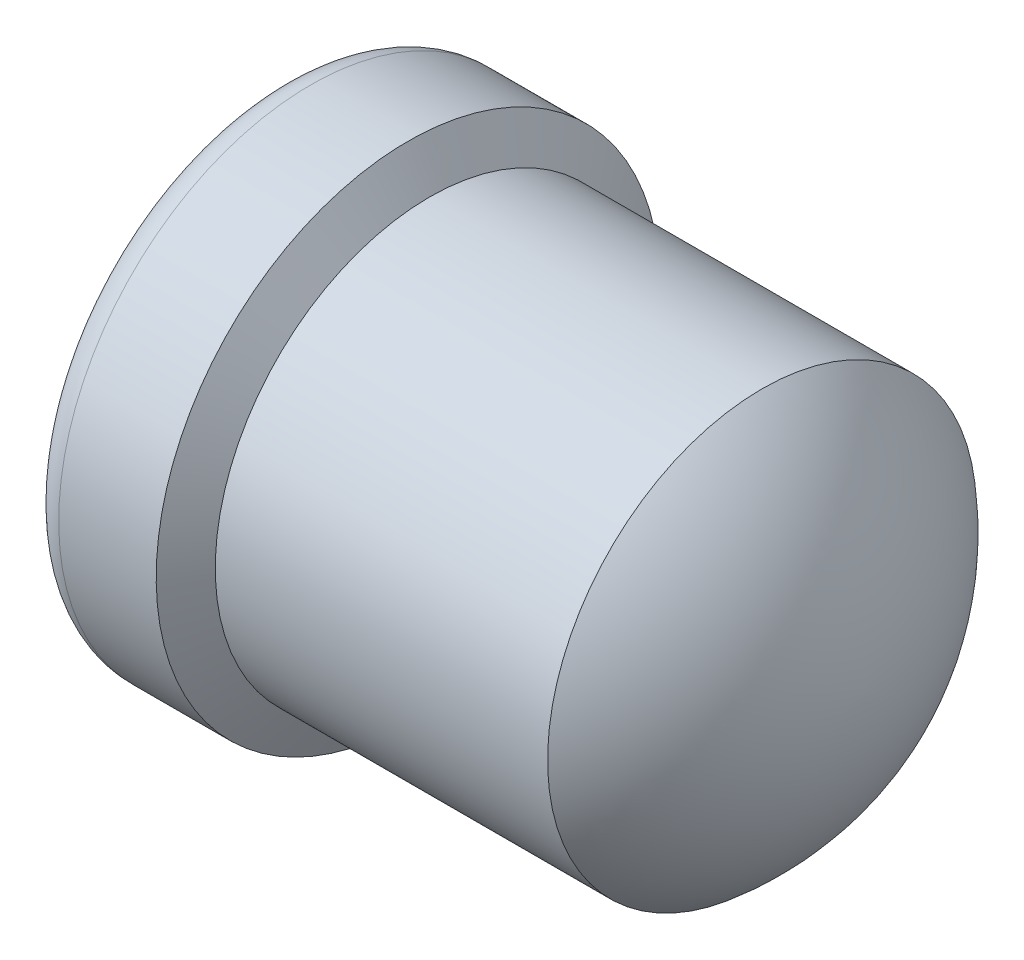
ISO-10303-21;
HEADER;
FILE_DESCRIPTION(('STEP AP214'),'2;1');
FILE_NAME('part.step','',(''),(''),'','','');
FILE_SCHEMA(('AUTOMOTIVE_DESIGN { 1 0 10303 214 1 1 1 1 }'));
ENDSEC;
DATA;
#1=APPLICATION_CONTEXT('core data for automotive mechanical design processes');
#2=APPLICATION_PROTOCOL_DEFINITION('international standard','automotive_design',2000,#1);
#3=PRODUCT_CONTEXT('',#1,'mechanical');
#4=PRODUCT('Part','Part','',(#3));
#5=PRODUCT_RELATED_PRODUCT_CATEGORY('part','',(#4));
#6=PRODUCT_DEFINITION_FORMATION('','',#4);
#7=PRODUCT_DEFINITION_CONTEXT('part definition',#1,'design');
#8=PRODUCT_DEFINITION('design','',#6,#7);
#9=PRODUCT_DEFINITION_SHAPE('','',#8);
#10=(LENGTH_UNIT() NAMED_UNIT(*) SI_UNIT(.MILLI.,.METRE.));
#11=(NAMED_UNIT(*) PLANE_ANGLE_UNIT() SI_UNIT($,.RADIAN.));
#12=(NAMED_UNIT(*) SI_UNIT($,.STERADIAN.) SOLID_ANGLE_UNIT());
#13=UNCERTAINTY_MEASURE_WITH_UNIT(LENGTH_MEASURE(1.E-05),#10,'distance_accuracy_value','');
#14=(GEOMETRIC_REPRESENTATION_CONTEXT(3) GLOBAL_UNCERTAINTY_ASSIGNED_CONTEXT((#13)) GLOBAL_UNIT_ASSIGNED_CONTEXT((#10,
#11,#12)) REPRESENTATION_CONTEXT('',''));
#15=CARTESIAN_POINT('',(0.,0.,0.));
#16=DIRECTION('',(0.,0.,1.));
#17=DIRECTION('',(1.,0.,0.));
#18=AXIS2_PLACEMENT_3D('',#15,#16,#17);
#19=CARTESIAN_POINT('',(0.736738308288009,0.014025354886126,0.));
#20=DIRECTION('',(0.,0.,-1.));
#21=DIRECTION('',(0.,-1.,0.));
#22=AXIS2_PLACEMENT_3D('',#19,#20,#21);
#23=CIRCLE('',#22,0.7112);
#24=TRIMMED_CURVE('',#23,(PARAMETER_VALUE(-1.55107435810092)),
(PARAMETER_VALUE(1.55107435810092)),.T.,.PARAMETER.);
#25=CARTESIAN_POINT('',(0.736738308288009,0.,0.));
#26=DIRECTION('',(-1.,0.,0.));
#27=AXIS1_PLACEMENT('',#25,#26);
#28=SURFACE_OF_REVOLUTION('',#24,#27);
#29=CARTESIAN_POINT('',(1.1938,0.,0.));
#30=DIRECTION('',(-1.,0.,0.));
#31=DIRECTION('',(0.,-1.,0.));
#32=AXIS2_PLACEMENT_3D('',#29,#30,#31);
#33=CIRCLE('',#32,0.530859999999994);
#34=CARTESIAN_POINT('',(1.1938,-0.530859999999994,0.));
#35=VERTEX_POINT('',#34);
#36=EDGE_CURVE('E11',#35,#35,#33,.T.);
#37=ORIENTED_EDGE('',*,*,#36,.F.);
#38=EDGE_LOOP('',(#37));
#39=FACE_BOUND('',#38,.T.);
#40=CARTESIAN_POINT('',(1.4478,0.,0.));
#41=VERTEX_POINT('',#40);
#42=VERTEX_LOOP('',#41);
#43=FACE_BOUND('',#42,.T.);
#44=ADVANCED_FACE('F32',(#39,#43),#28,.T.);
#45=CARTESIAN_POINT('',(0.,0.,0.));
#46=DIRECTION('',(-1.,0.,0.));
#47=DIRECTION('',(0.,-1.,0.));
#48=AXIS2_PLACEMENT_3D('',#45,#46,#47);
#49=CYLINDRICAL_SURFACE('',#48,0.530859999999994);
#50=CARTESIAN_POINT('',(0.371026143456576,0.,0.));
#51=DIRECTION('',(-1.,0.,0.));
#52=DIRECTION('',(0.,-1.,0.));
#53=AXIS2_PLACEMENT_3D('',#50,#51,#52);
#54=CIRCLE('',#53,0.530859999999994);
#55=CARTESIAN_POINT('',(0.371026143456576,-0.530859999999994,0.));
#56=VERTEX_POINT('',#55);
#57=EDGE_CURVE('E39',#56,#56,#54,.T.);
#58=ORIENTED_EDGE('',*,*,#57,.F.);
#59=EDGE_LOOP('',(#58));
#60=FACE_BOUND('',#59,.T.);
#61=ORIENTED_EDGE('',*,*,#36,.T.);
#62=EDGE_LOOP('',(#61));
#63=FACE_BOUND('',#62,.T.);
#64=ADVANCED_FACE('F75',(#60,#63),#49,.T.);
#65=CARTESIAN_POINT('',(0.371026143456576,0.,0.));
#66=DIRECTION('',(-1.,0.,0.));
#67=DIRECTION('',(0.,-1.,0.));
#68=AXIS2_PLACEMENT_3D('',#65,#66,#67);
#69=CONICAL_SURFACE('',#68,0.530859999999994,1.04719755119674);
#70=CARTESIAN_POINT('',(0.317500000000026,0.,0.));
#71=DIRECTION('',(-1.,0.,0.));
#72=DIRECTION('',(0.,-1.,0.));
#73=AXIS2_PLACEMENT_3D('',#70,#71,#72);
#74=CIRCLE('',#73,0.62356999999999);
#75=CARTESIAN_POINT('',(0.317500000000026,-0.62356999999999,0.));
#76=VERTEX_POINT('',#75);
#77=EDGE_CURVE('E68',#76,#76,#74,.T.);
#78=ORIENTED_EDGE('',*,*,#77,.F.);
#79=EDGE_LOOP('',(#78));
#80=FACE_BOUND('',#79,.T.);
#81=ORIENTED_EDGE('',*,*,#57,.T.);
#82=EDGE_LOOP('',(#81));
#83=FACE_BOUND('',#82,.T.);
#84=ADVANCED_FACE('F73',(#80,#83),#69,.T.);
#85=CARTESIAN_POINT('',(0.,0.,0.));
#86=DIRECTION('',(-1.,0.,0.));
#87=DIRECTION('',(0.,-1.,0.));
#88=AXIS2_PLACEMENT_3D('',#85,#86,#87);
#89=CYLINDRICAL_SURFACE('',#88,0.62356999999999);
#90=CARTESIAN_POINT('',(0.0762000000000007,0.,0.));
#91=DIRECTION('',(-1.,0.,0.));
#92=DIRECTION('',(0.,-1.,0.));
#93=AXIS2_PLACEMENT_3D('',#90,#91,#92);
#94=CIRCLE('',#93,0.62356999999999);
#95=CARTESIAN_POINT('',(0.0762000000000008,-0.62356999999999,0.));
#96=VERTEX_POINT('',#95);
#97=EDGE_CURVE('E59',#96,#96,#94,.T.);
#98=ORIENTED_EDGE('',*,*,#97,.F.);
#99=EDGE_LOOP('',(#98));
#100=FACE_BOUND('',#99,.T.);
#101=ORIENTED_EDGE('',*,*,#77,.T.);
#102=EDGE_LOOP('',(#101));
#103=FACE_BOUND('',#102,.T.);
#104=ADVANCED_FACE('F93',(#100,#103),#89,.T.);
#105=CARTESIAN_POINT('',(0.0762000000000001,0.,0.));
#106=DIRECTION('',(-1.,0.,0.));
#107=DIRECTION('',(0.,-1.,0.));
#108=AXIS2_PLACEMENT_3D('',#105,#106,#107);
#109=TOROIDAL_SURFACE('',#108,0.54736999999999,0.0762);
#110=CARTESIAN_POINT('',(0.,0.,0.));
#111=DIRECTION('',(-1.,0.,0.));
#112=DIRECTION('',(0.,-1.,0.));
#113=AXIS2_PLACEMENT_3D('',#110,#111,#112);
#114=CIRCLE('',#113,0.547369999999989);
#115=CARTESIAN_POINT('',(0.,-0.547369999999989,0.));
#116=VERTEX_POINT('',#115);
#117=EDGE_CURVE('E55',#116,#116,#114,.T.);
#118=ORIENTED_EDGE('',*,*,#117,.F.);
#119=EDGE_LOOP('',(#118));
#120=FACE_BOUND('',#119,.T.);
#121=ORIENTED_EDGE('',*,*,#97,.T.);
#122=EDGE_LOOP('',(#121));
#123=FACE_BOUND('',#122,.T.);
#124=ADVANCED_FACE('F101',(#120,#123),#109,.T.);
#125=CARTESIAN_POINT('',(0.,0.,0.));
#126=DIRECTION('',(1.,0.,0.));
#127=DIRECTION('',(0.,1.,0.));
#128=AXIS2_PLACEMENT_3D('',#125,#126,#127);
#129=PLANE('',#128);
#130=CARTESIAN_POINT('',(0.,0.,0.));
#131=DIRECTION('',(-1.,0.,0.));
#132=DIRECTION('',(0.,0.,1.));
#133=AXIS2_PLACEMENT_3D('',#130,#131,#132);
#134=CIRCLE('',#133,0.5461);
#135=CARTESIAN_POINT('',(0.,0.,0.5461));
#136=VERTEX_POINT('',#135);
#137=EDGE_CURVE('E62',#136,#136,#134,.T.);
#138=ORIENTED_EDGE('',*,*,#137,.F.);
#139=EDGE_LOOP('',(#138));
#140=FACE_BOUND('',#139,.T.);
#141=ORIENTED_EDGE('',*,*,#117,.T.);
#142=EDGE_LOOP('',(#141));
#143=FACE_BOUND('',#142,.T.);
#144=ADVANCED_FACE('F49',(#140,#143),#129,.F.);
#145=CARTESIAN_POINT('',(1.016,0.,0.));
#146=DIRECTION('',(-1.,0.,0.));
#147=DIRECTION('',(0.,0.,1.));
#148=AXIS2_PLACEMENT_3D('',#145,#146,#147);
#149=CONICAL_SURFACE('',#148,0.457199999999999,1.02974425867665);
#150=CARTESIAN_POINT('',(1.2907134750194,0.,0.));
#151=VERTEX_POINT('',#150);
#152=VERTEX_LOOP('',#151);
#153=FACE_BOUND('',#152,.T.);
#154=CARTESIAN_POINT('',(1.016,0.,0.));
#155=DIRECTION('',(-1.,0.,0.));
#156=DIRECTION('',(0.,0.,1.));
#157=AXIS2_PLACEMENT_3D('',#154,#155,#156);
#158=CIRCLE('',#157,0.457199999999999);
#159=CARTESIAN_POINT('',(1.016,0.,0.457199999999999));
#160=VERTEX_POINT('',#159);
#161=EDGE_CURVE('E53',#160,#160,#158,.T.);
#162=ORIENTED_EDGE('',*,*,#161,.T.);
#163=EDGE_LOOP('',(#162));
#164=FACE_BOUND('',#163,.T.);
#165=ADVANCED_FACE('F45',(#153,#164),#149,.F.);
#166=CARTESIAN_POINT('',(0.,0.,0.));
#167=DIRECTION('',(-1.,0.,0.));
#168=DIRECTION('',(0.,0.,1.));
#169=AXIS2_PLACEMENT_3D('',#166,#167,#168);
#170=CYLINDRICAL_SURFACE('',#169,0.457199999999999);
#171=ORIENTED_EDGE('',*,*,#161,.F.);
#172=EDGE_LOOP('',(#171));
#173=FACE_BOUND('',#172,.T.);
#174=CARTESIAN_POINT('',(0.153979316792873,0.,0.));
#175=DIRECTION('',(-1.,0.,0.));
#176=DIRECTION('',(0.,0.,1.));
#177=AXIS2_PLACEMENT_3D('',#174,#175,#176);
#178=CIRCLE('',#177,0.457199999999999);
#179=CARTESIAN_POINT('',(0.153979316792873,0.,0.457199999999999));
#180=VERTEX_POINT('',#179);
#181=EDGE_CURVE('E56',#180,#180,#178,.T.);
#182=ORIENTED_EDGE('',*,*,#181,.T.);
#183=EDGE_LOOP('',(#182));
#184=FACE_BOUND('',#183,.T.);
#185=ADVANCED_FACE('F48',(#173,#184),#170,.F.);
#186=CARTESIAN_POINT('',(0.,0.,0.));
#187=DIRECTION('',(-1.,0.,0.));
#188=DIRECTION('',(0.,0.,1.));
#189=AXIS2_PLACEMENT_3D('',#186,#187,#188);
#190=CONICAL_SURFACE('',#189,0.5461,0.523598775598298);
#191=ORIENTED_EDGE('',*,*,#181,.F.);
#192=EDGE_LOOP('',(#191));
#193=FACE_BOUND('',#192,.T.);
#194=ORIENTED_EDGE('',*,*,#137,.T.);
#195=EDGE_LOOP('',(#194));
#196=FACE_BOUND('',#195,.T.);
#197=ADVANCED_FACE('F127',(#193,#196),#190,.F.);
#198=CLOSED_SHELL('',(#44,#64,#84,#104,#124,#144,#165,#185,#197));
#199=MANIFOLD_SOLID_BREP('B2',#198);
#200=ADVANCED_BREP_SHAPE_REPRESENTATION('',(#18,#199),#14);
#201=SHAPE_DEFINITION_REPRESENTATION(#9,#200);
ENDSEC;
END-ISO-10303-21;
